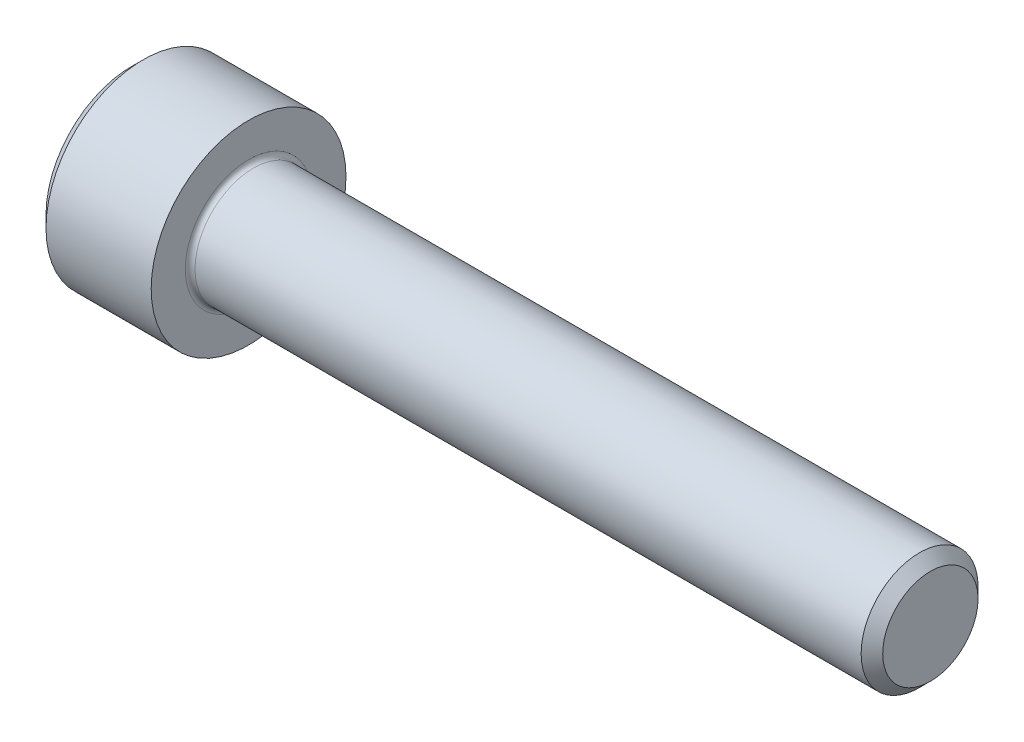
ISO-10303-21;
HEADER;
FILE_DESCRIPTION(('STEP AP214'),'2;1');
FILE_NAME('part.step','',(''),(''),'','','');
FILE_SCHEMA(('AUTOMOTIVE_DESIGN { 1 0 10303 214 1 1 1 1 }'));
ENDSEC;
DATA;
#1=APPLICATION_CONTEXT('core data for automotive mechanical design processes');
#2=APPLICATION_PROTOCOL_DEFINITION('international standard','automotive_design',2000,#1);
#3=PRODUCT_CONTEXT('',#1,'mechanical');
#4=PRODUCT('Part','Part','',(#3));
#5=PRODUCT_RELATED_PRODUCT_CATEGORY('part','',(#4));
#6=PRODUCT_DEFINITION_FORMATION('','',#4);
#7=PRODUCT_DEFINITION_CONTEXT('part definition',#1,'design');
#8=PRODUCT_DEFINITION('design','',#6,#7);
#9=PRODUCT_DEFINITION_SHAPE('','',#8);
#10=(LENGTH_UNIT() NAMED_UNIT(*) SI_UNIT(.MILLI.,.METRE.));
#11=(NAMED_UNIT(*) PLANE_ANGLE_UNIT() SI_UNIT($,.RADIAN.));
#12=(NAMED_UNIT(*) SI_UNIT($,.STERADIAN.) SOLID_ANGLE_UNIT());
#13=UNCERTAINTY_MEASURE_WITH_UNIT(LENGTH_MEASURE(1.E-05),#10,'distance_accuracy_value','');
#14=(GEOMETRIC_REPRESENTATION_CONTEXT(3) GLOBAL_UNCERTAINTY_ASSIGNED_CONTEXT((#13)) GLOBAL_UNIT_ASSIGNED_CONTEXT((#10,
#11,#12)) REPRESENTATION_CONTEXT('',''));
#15=CARTESIAN_POINT('',(0.,0.,0.));
#16=DIRECTION('',(0.,0.,1.));
#17=DIRECTION('',(1.,0.,0.));
#18=AXIS2_PLACEMENT_3D('',#15,#16,#17);
#19=CARTESIAN_POINT('',(0.,0.,0.));
#20=DIRECTION('',(-1.,0.,0.));
#21=DIRECTION('',(0.,0.,1.));
#22=AXIS2_PLACEMENT_3D('',#19,#20,#21);
#23=PLANE('',#22);
#24=DIRECTION('',(0.,-0.5,0.866025403784439));
#25=VECTOR('',#24,1.);
#26=CARTESIAN_POINT('',(0.,2.93524876856006,0.));
#27=LINE('',#26,#25);
#28=CARTESIAN_POINT('',(0.,2.93524876856006,0.));
#29=VERTEX_POINT('',#28);
#30=CARTESIAN_POINT('',(0.,1.46762438428003,2.542));
#31=VERTEX_POINT('',#30);
#32=EDGE_CURVE('E260',#29,#31,#27,.T.);
#33=ORIENTED_EDGE('',*,*,#32,.T.);
#34=DIRECTION('',(0.,1.,0.));
#35=VECTOR('',#34,1.);
#36=CARTESIAN_POINT('',(0.,-1.46762438428003,2.542));
#37=LINE('',#36,#35);
#38=CARTESIAN_POINT('',(0.,-1.46762438428003,2.542));
#39=VERTEX_POINT('',#38);
#40=EDGE_CURVE('E131',#39,#31,#37,.T.);
#41=ORIENTED_EDGE('',*,*,#40,.F.);
#42=DIRECTION('',(0.,-0.500000000000001,-0.866025403784438));
#43=VECTOR('',#42,1.);
#44=CARTESIAN_POINT('',(0.,-1.46762438428003,2.542));
#45=LINE('',#44,#43);
#46=CARTESIAN_POINT('',(0.,-2.93524876856006,0.));
#47=VERTEX_POINT('',#46);
#48=EDGE_CURVE('E263',#39,#47,#45,.T.);
#49=ORIENTED_EDGE('',*,*,#48,.T.);
#50=DIRECTION('',(0.,0.5,-0.866025403784439));
#51=VECTOR('',#50,1.);
#52=CARTESIAN_POINT('',(0.,-2.93524876856006,0.));
#53=LINE('',#52,#51);
#54=CARTESIAN_POINT('',(0.,-1.46762438428003,-2.542));
#55=VERTEX_POINT('',#54);
#56=EDGE_CURVE('E266',#47,#55,#53,.T.);
#57=ORIENTED_EDGE('',*,*,#56,.T.);
#58=DIRECTION('',(0.,-1.,0.));
#59=VECTOR('',#58,1.);
#60=CARTESIAN_POINT('',(0.,1.46762438428002,-2.542));
#61=LINE('',#60,#59);
#62=CARTESIAN_POINT('',(0.,1.46762438428002,-2.542));
#63=VERTEX_POINT('',#62);
#64=EDGE_CURVE('E269',#63,#55,#61,.T.);
#65=ORIENTED_EDGE('',*,*,#64,.F.);
#66=DIRECTION('',(0.,-0.500000000000001,-0.866025403784438));
#67=VECTOR('',#66,1.);
#68=CARTESIAN_POINT('',(0.,2.93524876856006,0.));
#69=LINE('',#68,#67);
#70=EDGE_CURVE('E126',#29,#63,#69,.T.);
#71=ORIENTED_EDGE('',*,*,#70,.F.);
#72=EDGE_LOOP('',(#33,#41,#49,#57,#65,#71));
#73=FACE_BOUND('',#72,.T.);
#74=CARTESIAN_POINT('',(0.,0.,0.));
#75=DIRECTION('',(-1.,0.,0.));
#76=DIRECTION('',(0.,0.,1.));
#77=AXIS2_PLACEMENT_3D('',#74,#75,#76);
#78=CIRCLE('',#77,4.4);
#79=CARTESIAN_POINT('',(0.,0.,4.4));
#80=VERTEX_POINT('',#79);
#81=EDGE_CURVE('E155',#80,#80,#78,.T.);
#82=ORIENTED_EDGE('',*,*,#81,.T.);
#83=EDGE_LOOP('',(#82));
#84=FACE_BOUND('',#83,.T.);
#85=ADVANCED_FACE('F35',(#73,#84),#23,.T.);
#86=CARTESIAN_POINT('',(0.,0.,0.));
#87=DIRECTION('',(1.,0.,0.));
#88=DIRECTION('',(0.,0.,-1.));
#89=AXIS2_PLACEMENT_3D('',#86,#87,#88);
#90=CONICAL_SURFACE('',#89,4.4,0.785398163397445);
#91=CARTESIAN_POINT('',(0.600000000000003,0.,0.));
#92=DIRECTION('',(-1.,0.,0.));
#93=DIRECTION('',(0.,0.,1.));
#94=AXIS2_PLACEMENT_3D('',#91,#92,#93);
#95=CIRCLE('',#94,5.);
#96=CARTESIAN_POINT('',(0.600000000000003,0.,5.));
#97=VERTEX_POINT('',#96);
#98=EDGE_CURVE('E152',#97,#97,#95,.T.);
#99=ORIENTED_EDGE('',*,*,#98,.T.);
#100=EDGE_LOOP('',(#99));
#101=FACE_BOUND('',#100,.T.);
#102=ORIENTED_EDGE('',*,*,#81,.F.);
#103=EDGE_LOOP('',(#102));
#104=FACE_BOUND('',#103,.T.);
#105=ADVANCED_FACE('F176',(#101,#104),#90,.T.);
#106=CARTESIAN_POINT('',(-31.75,0.,0.));
#107=DIRECTION('',(-1.,0.,0.));
#108=DIRECTION('',(0.,0.,1.));
#109=AXIS2_PLACEMENT_3D('',#106,#107,#108);
#110=CYLINDRICAL_SURFACE('',#109,5.);
#111=CARTESIAN_POINT('',(6.,0.,0.));
#112=DIRECTION('',(-1.,0.,0.));
#113=DIRECTION('',(0.,0.,1.));
#114=AXIS2_PLACEMENT_3D('',#111,#112,#113);
#115=CIRCLE('',#114,5.);
#116=CARTESIAN_POINT('',(6.,0.,5.));
#117=VERTEX_POINT('',#116);
#118=EDGE_CURVE('E149',#117,#117,#115,.T.);
#119=ORIENTED_EDGE('',*,*,#118,.T.);
#120=EDGE_LOOP('',(#119));
#121=FACE_BOUND('',#120,.T.);
#122=ORIENTED_EDGE('',*,*,#98,.F.);
#123=EDGE_LOOP('',(#122));
#124=FACE_BOUND('',#123,.T.);
#125=ADVANCED_FACE('F181',(#121,#124),#110,.T.);
#126=CARTESIAN_POINT('',(6.,5.,0.));
#127=DIRECTION('',(1.,0.,0.));
#128=DIRECTION('',(0.,0.,-1.));
#129=AXIS2_PLACEMENT_3D('',#126,#127,#128);
#130=PLANE('',#129);
#131=CARTESIAN_POINT('',(6.,0.,0.));
#132=DIRECTION('',(1.,0.,0.));
#133=DIRECTION('',(0.,0.,-1.));
#134=AXIS2_PLACEMENT_3D('',#131,#132,#133);
#135=CIRCLE('',#134,3.25);
#136=CARTESIAN_POINT('',(6.,0.,-3.25));
#137=VERTEX_POINT('',#136);
#138=EDGE_CURVE('E43',#137,#137,#135,.F.);
#139=ORIENTED_EDGE('',*,*,#138,.T.);
#140=EDGE_LOOP('',(#139));
#141=FACE_BOUND('',#140,.T.);
#142=ORIENTED_EDGE('',*,*,#118,.F.);
#143=EDGE_LOOP('',(#142));
#144=FACE_BOUND('',#143,.T.);
#145=ADVANCED_FACE('F160',(#141,#144),#130,.T.);
#146=CARTESIAN_POINT('',(-31.75,0.,0.));
#147=DIRECTION('',(-1.,0.,0.));
#148=DIRECTION('',(0.,0.,1.));
#149=AXIS2_PLACEMENT_3D('',#146,#147,#148);
#150=CYLINDRICAL_SURFACE('',#149,3.);
#151=CARTESIAN_POINT('',(6.25,0.,0.));
#152=DIRECTION('',(1.,0.,0.));
#153=DIRECTION('',(0.,0.,-1.));
#154=AXIS2_PLACEMENT_3D('',#151,#152,#153);
#155=CIRCLE('',#154,3.);
#156=CARTESIAN_POINT('',(6.25,0.,-3.));
#157=VERTEX_POINT('',#156);
#158=EDGE_CURVE('E11',#157,#157,#155,.T.);
#159=ORIENTED_EDGE('',*,*,#158,.T.);
#160=EDGE_LOOP('',(#159));
#161=FACE_BOUND('',#160,.T.);
#162=CARTESIAN_POINT('',(40.4455,0.,0.));
#163=DIRECTION('',(-1.,0.,0.));
#164=DIRECTION('',(0.,0.,1.));
#165=AXIS2_PLACEMENT_3D('',#162,#163,#164);
#166=CIRCLE('',#165,3.);
#167=CARTESIAN_POINT('',(40.4455,0.,3.));
#168=VERTEX_POINT('',#167);
#169=EDGE_CURVE('E146',#168,#168,#166,.T.);
#170=ORIENTED_EDGE('',*,*,#169,.T.);
#171=EDGE_LOOP('',(#170));
#172=FACE_BOUND('',#171,.T.);
#173=ADVANCED_FACE('F191',(#161,#172),#150,.T.);
#174=CARTESIAN_POINT('',(41.,0.,0.));
#175=DIRECTION('',(-1.,0.,0.));
#176=DIRECTION('',(0.,0.,1.));
#177=AXIS2_PLACEMENT_3D('',#174,#175,#176);
#178=CONICAL_SURFACE('',#177,2.4455,0.785398163397474);
#179=ORIENTED_EDGE('',*,*,#169,.F.);
#180=EDGE_LOOP('',(#179));
#181=FACE_BOUND('',#180,.T.);
#182=CARTESIAN_POINT('',(41.,0.,0.));
#183=DIRECTION('',(-1.,0.,0.));
#184=DIRECTION('',(0.,0.,1.));
#185=AXIS2_PLACEMENT_3D('',#182,#183,#184);
#186=CIRCLE('',#185,2.4455);
#187=CARTESIAN_POINT('',(41.,0.,2.4455));
#188=VERTEX_POINT('',#187);
#189=EDGE_CURVE('E142',#188,#188,#186,.T.);
#190=ORIENTED_EDGE('',*,*,#189,.T.);
#191=EDGE_LOOP('',(#190));
#192=FACE_BOUND('',#191,.T.);
#193=ADVANCED_FACE('F171',(#181,#192),#178,.T.);
#194=CARTESIAN_POINT('',(41.,2.4455,0.));
#195=DIRECTION('',(1.,0.,0.));
#196=DIRECTION('',(0.,0.,-1.));
#197=AXIS2_PLACEMENT_3D('',#194,#195,#196);
#198=PLANE('',#197);
#199=ORIENTED_EDGE('',*,*,#189,.F.);
#200=EDGE_LOOP('',(#199));
#201=FACE_BOUND('',#200,.T.);
#202=ADVANCED_FACE('F164',(#201),#198,.T.);
#203=CARTESIAN_POINT('',(6.25,0.,0.));
#204=DIRECTION('',(1.,0.,0.));
#205=DIRECTION('',(0.,0.,-1.));
#206=AXIS2_PLACEMENT_3D('',#203,#204,#205);
#207=TOROIDAL_SURFACE('',#206,3.25,0.25);
#208=ORIENTED_EDGE('',*,*,#158,.F.);
#209=EDGE_LOOP('',(#208));
#210=FACE_BOUND('',#209,.T.);
#211=ORIENTED_EDGE('',*,*,#138,.F.);
#212=EDGE_LOOP('',(#211));
#213=FACE_BOUND('',#212,.T.);
#214=ADVANCED_FACE('F37',(#210,#213),#207,.F.);
#215=CARTESIAN_POINT('',(3.,2.93524876856006,0.));
#216=DIRECTION('',(0.,-0.866025403784439,-0.5));
#217=DIRECTION('',(0.,0.5,-0.866025403784439));
#218=AXIS2_PLACEMENT_3D('',#215,#216,#217);
#219=PLANE('',#218);
#220=ORIENTED_EDGE('',*,*,#32,.F.);
#221=DIRECTION('',(-1.,0.,0.));
#222=VECTOR('',#221,1.);
#223=CARTESIAN_POINT('',(3.,2.93524876856006,0.));
#224=LINE('',#223,#222);
#225=CARTESIAN_POINT('',(3.,2.93524876856006,0.));
#226=VERTEX_POINT('',#225);
#227=EDGE_CURVE('E250',#226,#29,#224,.T.);
#228=ORIENTED_EDGE('',*,*,#227,.F.);
#229=DIRECTION('',(0.,-0.5,0.866025403784439));
#230=VECTOR('',#229,1.);
#231=CARTESIAN_POINT('',(3.,2.93524876856006,0.));
#232=LINE('',#231,#230);
#233=CARTESIAN_POINT('',(3.,2.20143657642004,1.271));
#234=VERTEX_POINT('',#233);
#235=EDGE_CURVE('E118',#226,#234,#232,.T.);
#236=ORIENTED_EDGE('',*,*,#235,.T.);
#237=CARTESIAN_POINT('',(3.,1.46762438428003,2.542));
#238=VERTEX_POINT('',#237);
#239=EDGE_CURVE('E109',#234,#238,#232,.T.);
#240=ORIENTED_EDGE('',*,*,#239,.T.);
#241=DIRECTION('',(-1.,0.,0.));
#242=VECTOR('',#241,1.);
#243=CARTESIAN_POINT('',(3.,1.46762438428003,2.542));
#244=LINE('',#243,#242);
#245=EDGE_CURVE('E123',#238,#31,#244,.T.);
#246=ORIENTED_EDGE('',*,*,#245,.T.);
#247=EDGE_LOOP('',(#220,#228,#236,#240,#246));
#248=FACE_BOUND('',#247,.T.);
#249=ADVANCED_FACE('F122',(#248),#219,.T.);
#250=CARTESIAN_POINT('',(3.,-1.46762438428003,2.542));
#251=DIRECTION('',(0.,0.,1.));
#252=DIRECTION('',(0.,-1.,0.));
#253=AXIS2_PLACEMENT_3D('',#250,#251,#252);
#254=PLANE('',#253);
#255=ORIENTED_EDGE('',*,*,#40,.T.);
#256=ORIENTED_EDGE('',*,*,#245,.F.);
#257=DIRECTION('',(0.,1.,0.));
#258=VECTOR('',#257,1.);
#259=CARTESIAN_POINT('',(3.,-1.46762438428003,2.542));
#260=LINE('',#259,#258);
#261=CARTESIAN_POINT('',(3.,0.,2.542));
#262=VERTEX_POINT('',#261);
#263=EDGE_CURVE('E106',#262,#238,#260,.T.);
#264=ORIENTED_EDGE('',*,*,#263,.F.);
#265=CARTESIAN_POINT('',(3.,-1.46762438428003,2.542));
#266=VERTEX_POINT('',#265);
#267=EDGE_CURVE('E117',#266,#262,#260,.T.);
#268=ORIENTED_EDGE('',*,*,#267,.F.);
#269=DIRECTION('',(-1.,0.,0.));
#270=VECTOR('',#269,1.);
#271=CARTESIAN_POINT('',(3.,-1.46762438428003,2.542));
#272=LINE('',#271,#270);
#273=EDGE_CURVE('E133',#266,#39,#272,.T.);
#274=ORIENTED_EDGE('',*,*,#273,.T.);
#275=EDGE_LOOP('',(#255,#256,#264,#268,#274));
#276=FACE_BOUND('',#275,.T.);
#277=ADVANCED_FACE('F128',(#276),#254,.F.);
#278=CARTESIAN_POINT('',(3.,-1.46762438428003,2.542));
#279=DIRECTION('',(0.,0.866025403784438,-0.500000000000001));
#280=DIRECTION('',(0.,0.500000000000001,0.866025403784438));
#281=AXIS2_PLACEMENT_3D('',#278,#279,#280);
#282=PLANE('',#281);
#283=ORIENTED_EDGE('',*,*,#48,.F.);
#284=ORIENTED_EDGE('',*,*,#273,.F.);
#285=DIRECTION('',(0.,-0.500000000000001,-0.866025403784438));
#286=VECTOR('',#285,1.);
#287=CARTESIAN_POINT('',(3.,-1.46762438428003,2.542));
#288=LINE('',#287,#286);
#289=CARTESIAN_POINT('',(3.,-2.20143657642004,1.271));
#290=VERTEX_POINT('',#289);
#291=EDGE_CURVE('E289',#266,#290,#288,.T.);
#292=ORIENTED_EDGE('',*,*,#291,.T.);
#293=CARTESIAN_POINT('',(3.,-2.93524876856006,0.));
#294=VERTEX_POINT('',#293);
#295=EDGE_CURVE('E278',#290,#294,#288,.T.);
#296=ORIENTED_EDGE('',*,*,#295,.T.);
#297=DIRECTION('',(-1.,0.,0.));
#298=VECTOR('',#297,1.);
#299=CARTESIAN_POINT('',(3.,-2.93524876856006,0.));
#300=LINE('',#299,#298);
#301=EDGE_CURVE('E138',#294,#47,#300,.T.);
#302=ORIENTED_EDGE('',*,*,#301,.T.);
#303=EDGE_LOOP('',(#283,#284,#292,#296,#302));
#304=FACE_BOUND('',#303,.T.);
#305=ADVANCED_FACE('F204',(#304),#282,.T.);
#306=CARTESIAN_POINT('',(3.,-2.93524876856006,0.));
#307=DIRECTION('',(0.,0.866025403784439,0.5));
#308=DIRECTION('',(0.,-0.5,0.866025403784439));
#309=AXIS2_PLACEMENT_3D('',#306,#307,#308);
#310=PLANE('',#309);
#311=ORIENTED_EDGE('',*,*,#56,.F.);
#312=ORIENTED_EDGE('',*,*,#301,.F.);
#313=DIRECTION('',(0.,0.5,-0.866025403784439));
#314=VECTOR('',#313,1.);
#315=CARTESIAN_POINT('',(3.,-2.93524876856006,0.));
#316=LINE('',#315,#314);
#317=CARTESIAN_POINT('',(3.,-2.20143657642005,-1.271));
#318=VERTEX_POINT('',#317);
#319=EDGE_CURVE('E256',#294,#318,#316,.T.);
#320=ORIENTED_EDGE('',*,*,#319,.T.);
#321=CARTESIAN_POINT('',(3.,-1.46762438428003,-2.542));
#322=VERTEX_POINT('',#321);
#323=EDGE_CURVE('E288',#318,#322,#316,.T.);
#324=ORIENTED_EDGE('',*,*,#323,.T.);
#325=DIRECTION('',(-1.,0.,0.));
#326=VECTOR('',#325,1.);
#327=CARTESIAN_POINT('',(3.,-1.46762438428003,-2.542));
#328=LINE('',#327,#326);
#329=EDGE_CURVE('E249',#322,#55,#328,.T.);
#330=ORIENTED_EDGE('',*,*,#329,.T.);
#331=EDGE_LOOP('',(#311,#312,#320,#324,#330));
#332=FACE_BOUND('',#331,.T.);
#333=ADVANCED_FACE('F207',(#332),#310,.T.);
#334=CARTESIAN_POINT('',(3.,1.46762438428002,-2.542));
#335=DIRECTION('',(0.,0.,-1.));
#336=DIRECTION('',(0.,1.,0.));
#337=AXIS2_PLACEMENT_3D('',#334,#335,#336);
#338=PLANE('',#337);
#339=ORIENTED_EDGE('',*,*,#64,.T.);
#340=ORIENTED_EDGE('',*,*,#329,.F.);
#341=DIRECTION('',(0.,-1.,0.));
#342=VECTOR('',#341,1.);
#343=CARTESIAN_POINT('',(3.,1.46762438428002,-2.542));
#344=LINE('',#343,#342);
#345=CARTESIAN_POINT('',(3.,0.,-2.542));
#346=VERTEX_POINT('',#345);
#347=EDGE_CURVE('E253',#346,#322,#344,.T.);
#348=ORIENTED_EDGE('',*,*,#347,.F.);
#349=CARTESIAN_POINT('',(3.,1.46762438428002,-2.542));
#350=VERTEX_POINT('',#349);
#351=EDGE_CURVE('E50',#350,#346,#344,.T.);
#352=ORIENTED_EDGE('',*,*,#351,.F.);
#353=DIRECTION('',(-1.,0.,0.));
#354=VECTOR('',#353,1.);
#355=CARTESIAN_POINT('',(3.,1.46762438428002,-2.542));
#356=LINE('',#355,#354);
#357=EDGE_CURVE('E246',#350,#63,#356,.T.);
#358=ORIENTED_EDGE('',*,*,#357,.T.);
#359=EDGE_LOOP('',(#339,#340,#348,#352,#358));
#360=FACE_BOUND('',#359,.T.);
#361=ADVANCED_FACE('F211',(#360),#338,.F.);
#362=CARTESIAN_POINT('',(3.,2.93524876856006,0.));
#363=DIRECTION('',(0.,0.866025403784438,-0.500000000000001));
#364=DIRECTION('',(0.,0.500000000000001,0.866025403784438));
#365=AXIS2_PLACEMENT_3D('',#362,#363,#364);
#366=PLANE('',#365);
#367=ORIENTED_EDGE('',*,*,#70,.T.);
#368=ORIENTED_EDGE('',*,*,#357,.F.);
#369=DIRECTION('',(0.,-0.500000000000001,-0.866025403784438));
#370=VECTOR('',#369,1.);
#371=CARTESIAN_POINT('',(3.,2.93524876856006,0.));
#372=LINE('',#371,#370);
#373=CARTESIAN_POINT('',(3.,2.20143657642004,-1.271));
#374=VERTEX_POINT('',#373);
#375=EDGE_CURVE('E236',#374,#350,#372,.T.);
#376=ORIENTED_EDGE('',*,*,#375,.F.);
#377=EDGE_CURVE('E242',#226,#374,#372,.T.);
#378=ORIENTED_EDGE('',*,*,#377,.F.);
#379=ORIENTED_EDGE('',*,*,#227,.T.);
#380=EDGE_LOOP('',(#367,#368,#376,#378,#379));
#381=FACE_BOUND('',#380,.T.);
#382=ADVANCED_FACE('F215',(#381),#366,.F.);
#383=CARTESIAN_POINT('',(3.,2.93524876856006,0.));
#384=DIRECTION('',(1.,0.,0.));
#385=DIRECTION('',(0.,0.,-1.));
#386=AXIS2_PLACEMENT_3D('',#383,#384,#385);
#387=PLANE('',#386);
#388=ORIENTED_EDGE('',*,*,#347,.T.);
#389=ORIENTED_EDGE('',*,*,#323,.F.);
#390=CARTESIAN_POINT('',(3.,0.,0.));
#391=DIRECTION('',(-1.,0.,0.));
#392=DIRECTION('',(0.,0.,1.));
#393=AXIS2_PLACEMENT_3D('',#390,#391,#392);
#394=CIRCLE('',#393,2.542);
#395=EDGE_CURVE('E284',#346,#318,#394,.T.);
#396=ORIENTED_EDGE('',*,*,#395,.F.);
#397=EDGE_LOOP('',(#388,#389,#396));
#398=FACE_BOUND('',#397,.T.);
#399=ADVANCED_FACE('F219',(#398),#387,.F.);
#400=ORIENTED_EDGE('',*,*,#319,.F.);
#401=ORIENTED_EDGE('',*,*,#295,.F.);
#402=EDGE_CURVE('E136',#318,#290,#394,.T.);
#403=ORIENTED_EDGE('',*,*,#402,.F.);
#404=EDGE_LOOP('',(#400,#401,#403));
#405=FACE_BOUND('',#404,.T.);
#406=ADVANCED_FACE('F222',(#405),#387,.F.);
#407=ORIENTED_EDGE('',*,*,#291,.F.);
#408=ORIENTED_EDGE('',*,*,#267,.T.);
#409=EDGE_CURVE('E132',#290,#262,#394,.T.);
#410=ORIENTED_EDGE('',*,*,#409,.F.);
#411=EDGE_LOOP('',(#407,#408,#410));
#412=FACE_BOUND('',#411,.T.);
#413=ADVANCED_FACE('F227',(#412),#387,.F.);
#414=ORIENTED_EDGE('',*,*,#263,.T.);
#415=ORIENTED_EDGE('',*,*,#239,.F.);
#416=EDGE_CURVE('E112',#262,#234,#394,.T.);
#417=ORIENTED_EDGE('',*,*,#416,.F.);
#418=EDGE_LOOP('',(#414,#415,#417));
#419=FACE_BOUND('',#418,.T.);
#420=ADVANCED_FACE('F108',(#419),#387,.F.);
#421=ORIENTED_EDGE('',*,*,#235,.F.);
#422=ORIENTED_EDGE('',*,*,#377,.T.);
#423=EDGE_CURVE('E143',#234,#374,#394,.T.);
#424=ORIENTED_EDGE('',*,*,#423,.F.);
#425=EDGE_LOOP('',(#421,#422,#424));
#426=FACE_BOUND('',#425,.T.);
#427=ADVANCED_FACE('F230',(#426),#387,.F.);
#428=ORIENTED_EDGE('',*,*,#375,.T.);
#429=ORIENTED_EDGE('',*,*,#351,.T.);
#430=EDGE_CURVE('E239',#374,#346,#394,.T.);
#431=ORIENTED_EDGE('',*,*,#430,.F.);
#432=EDGE_LOOP('',(#428,#429,#431));
#433=FACE_BOUND('',#432,.T.);
#434=ADVANCED_FACE('F200',(#433),#387,.F.);
#435=CARTESIAN_POINT('',(3.,0.,0.));
#436=DIRECTION('',(-1.,0.,0.));
#437=DIRECTION('',(0.,0.,1.));
#438=AXIS2_PLACEMENT_3D('',#435,#436,#437);
#439=CONICAL_SURFACE('',#438,2.542,1.04719755119659);
#440=CARTESIAN_POINT('',(4.46762438428004,0.,0.));
#441=VERTEX_POINT('',#440);
#442=VERTEX_LOOP('',#441);
#443=FACE_BOUND('',#442,.T.);
#444=ORIENTED_EDGE('',*,*,#416,.T.);
#445=ORIENTED_EDGE('',*,*,#423,.T.);
#446=ORIENTED_EDGE('',*,*,#430,.T.);
#447=ORIENTED_EDGE('',*,*,#395,.T.);
#448=ORIENTED_EDGE('',*,*,#402,.T.);
#449=ORIENTED_EDGE('',*,*,#409,.T.);
#450=EDGE_LOOP('',(#444,#445,#446,#447,#448,#449));
#451=FACE_BOUND('',#450,.T.);
#452=ADVANCED_FACE('F198',(#443,#451),#439,.F.);
#453=CLOSED_SHELL('',(#85,#105,#125,#145,#173,#193,#202,#214,#249,#277,#305,#333,#361,#382,#399,
#406,#413,#420,#427,#434,#452));
#454=MANIFOLD_SOLID_BREP('B2',#453);
#455=ADVANCED_BREP_SHAPE_REPRESENTATION('',(#18,#454),#14);
#456=SHAPE_DEFINITION_REPRESENTATION(#9,#455);
ENDSEC;
END-ISO-10303-21;
